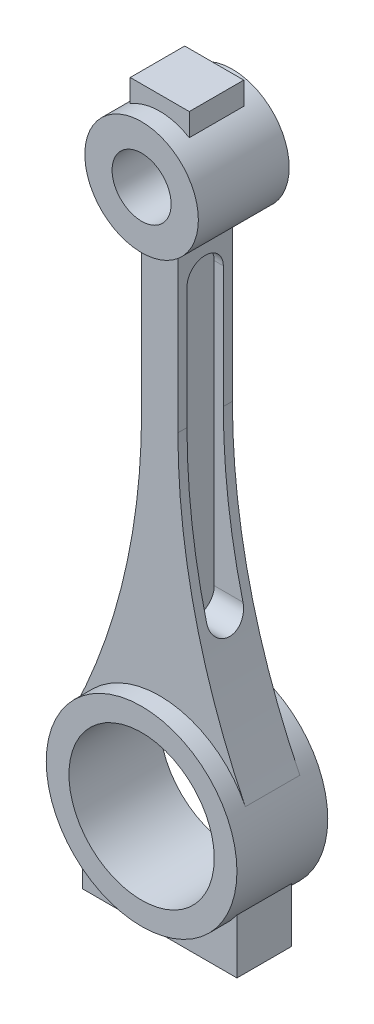
ISO-10303-21;
HEADER;
FILE_DESCRIPTION(('STEP AP214'),'2;1');
FILE_NAME('part.step','',(''),(''),'','','');
FILE_SCHEMA(('AUTOMOTIVE_DESIGN { 1 0 10303 214 1 1 1 1 }'));
ENDSEC;
DATA;
#1=APPLICATION_CONTEXT('core data for automotive mechanical design processes');
#2=APPLICATION_PROTOCOL_DEFINITION('international standard','automotive_design',2000,#1);
#3=PRODUCT_CONTEXT('',#1,'mechanical');
#4=PRODUCT('Part','Part','',(#3));
#5=PRODUCT_RELATED_PRODUCT_CATEGORY('part','',(#4));
#6=PRODUCT_DEFINITION_FORMATION('','',#4);
#7=PRODUCT_DEFINITION_CONTEXT('part definition',#1,'design');
#8=PRODUCT_DEFINITION('design','',#6,#7);
#9=PRODUCT_DEFINITION_SHAPE('','',#8);
#10=(LENGTH_UNIT() NAMED_UNIT(*) SI_UNIT(.MILLI.,.METRE.));
#11=(NAMED_UNIT(*) PLANE_ANGLE_UNIT() SI_UNIT($,.RADIAN.));
#12=(NAMED_UNIT(*) SI_UNIT($,.STERADIAN.) SOLID_ANGLE_UNIT());
#13=UNCERTAINTY_MEASURE_WITH_UNIT(LENGTH_MEASURE(1.E-05),#10,'distance_accuracy_value','');
#14=(GEOMETRIC_REPRESENTATION_CONTEXT(3) GLOBAL_UNCERTAINTY_ASSIGNED_CONTEXT((#13)) GLOBAL_UNIT_ASSIGNED_CONTEXT((#10,
#11,#12)) REPRESENTATION_CONTEXT('',''));
#15=CARTESIAN_POINT('',(0.,0.,0.));
#16=DIRECTION('',(0.,0.,1.));
#17=DIRECTION('',(1.,0.,0.));
#18=AXIS2_PLACEMENT_3D('',#15,#16,#17);
#19=CARTESIAN_POINT('',(148.911403588365,-46.842719282327,6.));
#20=DIRECTION('',(0.,0.,-1.));
#21=DIRECTION('',(-1.,0.,0.));
#22=AXIS2_PLACEMENT_3D('',#19,#20,#21);
#23=CYLINDRICAL_SURFACE('',#22,144.911403588365);
#24=DIRECTION('',(0.,0.,-1.));
#25=VECTOR('',#24,1.);
#26=CARTESIAN_POINT('',(4.,-46.842719282327,6.));
#27=LINE('',#26,#25);
#28=CARTESIAN_POINT('',(4.,-46.842719282327,-4.));
#29=VERTEX_POINT('',#28);
#30=CARTESIAN_POINT('',(4.,-46.842719282327,-6.));
#31=VERTEX_POINT('',#30);
#32=EDGE_CURVE('E387',#29,#31,#27,.T.);
#33=ORIENTED_EDGE('',*,*,#32,.F.);
#34=CARTESIAN_POINT('',(148.911403588365,-46.842719282327,-4.));
#35=DIRECTION('',(0.,0.,1.));
#36=DIRECTION('',(1.,0.,0.));
#37=AXIS2_PLACEMENT_3D('',#34,#35,#36);
#38=CIRCLE('',#37,144.911403588365);
#39=CARTESIAN_POINT('',(8.32946839579221,-82.,-4.));
#40=VERTEX_POINT('',#39);
#41=EDGE_CURVE('E239',#29,#40,#38,.T.);
#42=ORIENTED_EDGE('',*,*,#41,.T.);
#43=CARTESIAN_POINT('',(8.32946839579221,-82.,-4.));
#44=CARTESIAN_POINT('',(8.35837260753617,-82.1155838754006,-4.00000874523484));
#45=CARTESIAN_POINT('',(8.38742066172271,-82.2311257590194,-3.99499010452966));
#46=CARTESIAN_POINT('',(8.44559279586119,-82.4613222165068,-3.97498579266261));
#47=CARTESIAN_POINT('',(8.47471687444068,-82.5759768062473,-3.96000030020519));
#48=CARTESIAN_POINT('',(8.53283267046999,-82.8036082497815,-3.92014849754489));
#49=CARTESIAN_POINT('',(8.56182437763423,-82.9165849746877,-3.89528143230587));
#50=CARTESIAN_POINT('',(8.61944225017928,-83.1400168950437,-3.83584971060536));
#51=CARTESIAN_POINT('',(8.64806842086389,-83.2504721270979,-3.8012851950184));
#52=CARTESIAN_POINT('',(8.7331013422553,-83.5770198694853,-3.68327068137728));
#53=CARTESIAN_POINT('',(8.78867833589756,-83.7883563565845,-3.58548884497471));
#54=CARTESIAN_POINT('',(8.89559591006272,-84.1915095041504,-3.35429989024324));
#55=CARTESIAN_POINT('',(8.94693802861055,-84.3833332572217,-3.22090578083886));
#56=CARTESIAN_POINT('',(9.04300576815875,-84.7396830550554,-2.92358052770057));
#57=CARTESIAN_POINT('',(9.08780131435431,-84.9045002885207,-2.76002207409606));
#58=CARTESIAN_POINT('',(9.1697090629255,-85.2041309943854,-2.40569412503592));
#59=CARTESIAN_POINT('',(9.20682139215513,-85.3389449621574,-2.21492507892954));
#60=CARTESIAN_POINT('',(9.27072101308072,-85.5700821030688,-1.81811355062964));
#61=CARTESIAN_POINT('',(9.29780102039584,-85.6675001245802,-1.61275626380543));
#62=CARTESIAN_POINT('',(9.34207733010017,-85.826368651202,-1.18758849871992));
#63=CARTESIAN_POINT('',(9.35927642901819,-85.8878293331734,-0.967782129534331));
#64=CARTESIAN_POINT('',(9.38260496428717,-85.9711112965693,-0.527914983305013));
#65=CARTESIAN_POINT('',(9.38908744428568,-85.9941969380078,-0.308111695869451));
#66=CARTESIAN_POINT('',(9.39180268836639,-86.0038721042121,0.13235163572554));
#67=CARTESIAN_POINT('',(9.38803648660552,-85.9904653112958,0.353011591198101));
#68=CARTESIAN_POINT('',(9.37056692256844,-85.9281486758924,0.785217084723297));
#69=CARTESIAN_POINT('',(9.35702353638242,-85.8798103764088,0.996851968052392));
#70=CARTESIAN_POINT('',(9.320754146738,-85.7499164259824,1.40882234930645));
#71=CARTESIAN_POINT('',(9.29802789750906,-85.6683598859847,1.60915754464249));
#72=CARTESIAN_POINT('',(9.24402839371224,-85.4736584165545,1.99522585182686));
#73=CARTESIAN_POINT('',(9.21266853643914,-85.3601931525549,2.18078503400007));
#74=CARTESIAN_POINT('',(9.14271538853011,-85.1055742787722,2.53025004617875));
#75=CARTESIAN_POINT('',(9.10412150934586,-84.9644184160832,2.69415411250794));
#76=CARTESIAN_POINT('',(9.01981577606695,-84.6538968272369,3.00098201513396));
#77=CARTESIAN_POINT('',(8.97392485663143,-84.4838107742403,3.14312725760148));
#78=CARTESIAN_POINT('',(8.87747412379945,-84.1233879962609,3.39703478208648));
#79=CARTESIAN_POINT('',(8.82691201718461,-83.9330413177107,3.50878203354318));
#80=CARTESIAN_POINT('',(8.72093513280076,-83.5304860720347,3.70260044170905));
#81=CARTESIAN_POINT('',(8.66541311083078,-83.3177497748887,3.78351453035859));
#82=CARTESIAN_POINT('',(8.55285996455555,-82.8822045924085,3.90805235050602));
#83=CARTESIAN_POINT('',(8.49583103238981,-82.6594100370179,3.95172747426984));
#84=CARTESIAN_POINT('',(8.42061430849379,-82.3625538070276,3.98420167842466));
#85=CARTESIAN_POINT('',(8.40232032365708,-82.2901173866357,3.99012850935214));
#86=CARTESIAN_POINT('',(8.36582413413568,-82.1451347738394,3.99802244183978));
#87=CARTESIAN_POINT('',(8.34762182727392,-82.0725889659064,3.99999612991472));
#88=CARTESIAN_POINT('',(8.32946839579223,-82.,4.));
#89=B_SPLINE_CURVE_WITH_KNOTS('',3,(#43,#44,#45,#46,#47,#48,#49,#50,#51,#52,#53,#54,#55,#56,#57,
#58,#59,#60,#61,#62,#63,#64,#65,#66,#67,#68,#69,#70,#71,#72,#73,#74,#75,#76,#77,#78,#79,#80,#81,
#82,#83,#84,#85,#86,#87,#88),.UNSPECIFIED.,.F.,.F.,(4,2,2,2,2,2,2,2,2,2,2,2,2,2,2,2,2,2,2,2,2,2,
4),(0.,0.357313371389551,0.71462033636667,1.07195460788373,1.42928368868642,2.143749776244,
2.85795523039647,3.5638650499022,4.26976321353058,4.95304444363999,5.63613219374617,
6.29623235756107,6.95626591555552,7.60573779643776,8.25522706096615,8.91148484382824,
9.56779604195492,10.2438322043452,10.9202020338022,11.619910885033,12.318652520939,
12.543414847487,12.7678023745308),.UNSPECIFIED.);
#90=CARTESIAN_POINT('',(8.32946839579221,-82.,4.));
#91=VERTEX_POINT('',#90);
#92=EDGE_CURVE('E11',#40,#91,#89,.T.);
#93=ORIENTED_EDGE('',*,*,#92,.T.);
#94=CARTESIAN_POINT('',(148.911403588365,-46.842719282327,4.));
#95=DIRECTION('',(0.,0.,-1.));
#96=DIRECTION('',(-1.,0.,0.));
#97=AXIS2_PLACEMENT_3D('',#94,#95,#96);
#98=CIRCLE('',#97,144.911403588365);
#99=CARTESIAN_POINT('',(4.,-46.842719282327,4.));
#100=VERTEX_POINT('',#99);
#101=EDGE_CURVE('E214',#91,#100,#98,.T.);
#102=ORIENTED_EDGE('',*,*,#101,.T.);
#103=CARTESIAN_POINT('',(4.,-46.842719282327,6.));
#104=VERTEX_POINT('',#103);
#105=EDGE_CURVE('E388',#104,#100,#27,.T.);
#106=ORIENTED_EDGE('',*,*,#105,.F.);
#107=CARTESIAN_POINT('',(148.911403588365,-46.842719282327,6.));
#108=DIRECTION('',(0.,0.,1.));
#109=DIRECTION('',(1.,0.,0.));
#110=AXIS2_PLACEMENT_3D('',#107,#108,#109);
#111=CIRCLE('',#110,144.911403588365);
#112=CARTESIAN_POINT('',(18.8482491722767,-110.740221215398,6.));
#113=VERTEX_POINT('',#112);
#114=EDGE_CURVE('E341',#104,#113,#111,.T.);
#115=ORIENTED_EDGE('',*,*,#114,.T.);
#116=DIRECTION('',(0.,0.,-1.));
#117=VECTOR('',#116,1.);
#118=CARTESIAN_POINT('',(18.8482491722767,-110.740221215398,6.));
#119=LINE('',#118,#117);
#120=CARTESIAN_POINT('',(18.8482491722767,-110.740221215398,-6.));
#121=VERTEX_POINT('',#120);
#122=EDGE_CURVE('E357',#113,#121,#119,.T.);
#123=ORIENTED_EDGE('',*,*,#122,.T.);
#124=CARTESIAN_POINT('',(148.911403588365,-46.842719282327,-6.));
#125=DIRECTION('',(0.,0.,1.));
#126=DIRECTION('',(1.,0.,0.));
#127=AXIS2_PLACEMENT_3D('',#124,#125,#126);
#128=CIRCLE('',#127,144.911403588365);
#129=EDGE_CURVE('E336',#31,#121,#128,.T.);
#130=ORIENTED_EDGE('',*,*,#129,.F.);
#131=EDGE_LOOP('',(#33,#42,#93,#102,#106,#115,#123,#130));
#132=FACE_BOUND('',#131,.T.);
#133=ADVANCED_FACE('F38',(#132),#23,.F.);
#134=CARTESIAN_POINT('',(4.,0.,6.));
#135=DIRECTION('',(1.,0.,0.));
#136=DIRECTION('',(0.,1.,0.));
#137=AXIS2_PLACEMENT_3D('',#134,#135,#136);
#138=PLANE('',#137);
#139=CARTESIAN_POINT('',(4.,-20.,0.));
#140=DIRECTION('',(1.,0.,0.));
#141=DIRECTION('',(0.,1.,0.));
#142=AXIS2_PLACEMENT_3D('',#139,#140,#141);
#143=CIRCLE('',#142,4.);
#144=CARTESIAN_POINT('',(4.,-20.,4.));
#145=VERTEX_POINT('',#144);
#146=CARTESIAN_POINT('',(4.,-20.,-4.));
#147=VERTEX_POINT('',#146);
#148=EDGE_CURVE('E547',#145,#147,#143,.F.);
#149=ORIENTED_EDGE('',*,*,#148,.T.);
#150=DIRECTION('',(0.,-1.,0.));
#151=VECTOR('',#150,1.);
#152=CARTESIAN_POINT('',(4.,0.,-4.));
#153=LINE('',#152,#151);
#154=EDGE_CURVE('E52',#147,#29,#153,.T.);
#155=ORIENTED_EDGE('',*,*,#154,.T.);
#156=ORIENTED_EDGE('',*,*,#32,.T.);
#157=DIRECTION('',(0.,-1.,0.));
#158=VECTOR('',#157,1.);
#159=CARTESIAN_POINT('',(4.,0.,-6.));
#160=LINE('',#159,#158);
#161=CARTESIAN_POINT('',(4.,-11.842719282327,-6.));
#162=VERTEX_POINT('',#161);
#163=EDGE_CURVE('E360',#162,#31,#160,.T.);
#164=ORIENTED_EDGE('',*,*,#163,.F.);
#165=DIRECTION('',(0.,0.,-1.));
#166=VECTOR('',#165,1.);
#167=CARTESIAN_POINT('',(4.,-11.842719282327,6.));
#168=LINE('',#167,#166);
#169=CARTESIAN_POINT('',(4.,-11.842719282327,6.));
#170=VERTEX_POINT('',#169);
#171=EDGE_CURVE('E385',#170,#162,#168,.T.);
#172=ORIENTED_EDGE('',*,*,#171,.F.);
#173=DIRECTION('',(0.,-1.,0.));
#174=VECTOR('',#173,1.);
#175=CARTESIAN_POINT('',(4.,0.,6.));
#176=LINE('',#175,#174);
#177=EDGE_CURVE('E344',#170,#104,#176,.T.);
#178=ORIENTED_EDGE('',*,*,#177,.T.);
#179=ORIENTED_EDGE('',*,*,#105,.T.);
#180=DIRECTION('',(0.,1.,0.));
#181=VECTOR('',#180,1.);
#182=CARTESIAN_POINT('',(4.,0.,4.));
#183=LINE('',#182,#181);
#184=EDGE_CURVE('E548',#100,#145,#183,.T.);
#185=ORIENTED_EDGE('',*,*,#184,.T.);
#186=EDGE_LOOP('',(#149,#155,#156,#164,#172,#178,#179,#185));
#187=FACE_BOUND('',#186,.T.);
#188=ADVANCED_FACE('F495',(#187),#138,.T.);
#189=CARTESIAN_POINT('',(0.,-120.,10.));
#190=DIRECTION('',(0.,0.,-1.));
#191=DIRECTION('',(-1.,0.,0.));
#192=AXIS2_PLACEMENT_3D('',#189,#190,#191);
#193=CYLINDRICAL_SURFACE('',#192,16.);
#194=CARTESIAN_POINT('',(0.,-120.,10.));
#195=DIRECTION('',(0.,0.,1.));
#196=DIRECTION('',(1.,0.,0.));
#197=AXIS2_PLACEMENT_3D('',#194,#195,#196);
#198=CIRCLE('',#197,16.);
#199=CARTESIAN_POINT('',(16.,-120.,10.));
#200=VERTEX_POINT('',#199);
#201=EDGE_CURVE('E392',#200,#200,#198,.T.);
#202=ORIENTED_EDGE('',*,*,#201,.T.);
#203=EDGE_LOOP('',(#202));
#204=FACE_BOUND('',#203,.T.);
#205=CARTESIAN_POINT('',(0.,-120.,-10.));
#206=DIRECTION('',(0.,0.,1.));
#207=DIRECTION('',(1.,0.,0.));
#208=AXIS2_PLACEMENT_3D('',#205,#206,#207);
#209=CIRCLE('',#208,16.);
#210=CARTESIAN_POINT('',(16.,-120.,-10.));
#211=VERTEX_POINT('',#210);
#212=EDGE_CURVE('E391',#211,#211,#209,.T.);
#213=ORIENTED_EDGE('',*,*,#212,.F.);
#214=EDGE_LOOP('',(#213));
#215=FACE_BOUND('',#214,.T.);
#216=ADVANCED_FACE('F40',(#204,#215),#193,.F.);
#217=CARTESIAN_POINT('',(0.,-120.,10.));
#218=DIRECTION('',(0.,0.,-1.));
#219=DIRECTION('',(-1.,0.,0.));
#220=AXIS2_PLACEMENT_3D('',#217,#218,#219);
#221=CYLINDRICAL_SURFACE('',#220,21.);
#222=DIRECTION('',(0.,0.,-1.));
#223=VECTOR('',#222,1.);
#224=CARTESIAN_POINT('',(-17.,-132.328828005938,6.));
#225=LINE('',#224,#223);
#226=CARTESIAN_POINT('',(-17.,-132.328828005938,6.));
#227=VERTEX_POINT('',#226);
#228=CARTESIAN_POINT('',(-17.,-132.328828005938,-6.));
#229=VERTEX_POINT('',#228);
#230=EDGE_CURVE('E325',#227,#229,#225,.T.);
#231=ORIENTED_EDGE('',*,*,#230,.F.);
#232=CARTESIAN_POINT('',(0.,-120.,6.));
#233=DIRECTION('',(0.,0.,1.));
#234=DIRECTION('',(1.,0.,0.));
#235=AXIS2_PLACEMENT_3D('',#232,#233,#234);
#236=CIRCLE('',#235,21.);
#237=CARTESIAN_POINT('',(17.,-132.328828005938,6.));
#238=VERTEX_POINT('',#237);
#239=EDGE_CURVE('E298',#227,#238,#236,.T.);
#240=ORIENTED_EDGE('',*,*,#239,.T.);
#241=DIRECTION('',(0.,0.,-1.));
#242=VECTOR('',#241,1.);
#243=CARTESIAN_POINT('',(17.,-132.328828005938,6.));
#244=LINE('',#243,#242);
#245=CARTESIAN_POINT('',(17.,-132.328828005938,-6.));
#246=VERTEX_POINT('',#245);
#247=EDGE_CURVE('E309',#238,#246,#244,.T.);
#248=ORIENTED_EDGE('',*,*,#247,.T.);
#249=CARTESIAN_POINT('',(0.,-120.,-6.));
#250=DIRECTION('',(0.,0.,1.));
#251=DIRECTION('',(1.,0.,0.));
#252=AXIS2_PLACEMENT_3D('',#249,#250,#251);
#253=CIRCLE('',#252,21.);
#254=EDGE_CURVE('E297',#229,#246,#253,.T.);
#255=ORIENTED_EDGE('',*,*,#254,.F.);
#256=EDGE_LOOP('',(#231,#240,#248,#255));
#257=FACE_BOUND('',#256,.T.);
#258=ORIENTED_EDGE('',*,*,#122,.F.);
#259=CARTESIAN_POINT('',(0.,-120.,6.));
#260=DIRECTION('',(0.,0.,1.));
#261=DIRECTION('',(1.,0.,0.));
#262=AXIS2_PLACEMENT_3D('',#259,#260,#261);
#263=CIRCLE('',#262,21.);
#264=CARTESIAN_POINT('',(-18.8482491722767,-110.740221215398,6.));
#265=VERTEX_POINT('',#264);
#266=EDGE_CURVE('E355',#113,#265,#263,.T.);
#267=ORIENTED_EDGE('',*,*,#266,.T.);
#268=DIRECTION('',(0.,0.,-1.));
#269=VECTOR('',#268,1.);
#270=CARTESIAN_POINT('',(-18.8482491722767,-110.740221215398,6.));
#271=LINE('',#270,#269);
#272=CARTESIAN_POINT('',(-18.8482491722767,-110.740221215398,-6.));
#273=VERTEX_POINT('',#272);
#274=EDGE_CURVE('E376',#265,#273,#271,.T.);
#275=ORIENTED_EDGE('',*,*,#274,.T.);
#276=CARTESIAN_POINT('',(0.,-120.,-6.));
#277=DIRECTION('',(0.,0.,1.));
#278=DIRECTION('',(1.,0.,0.));
#279=AXIS2_PLACEMENT_3D('',#276,#277,#278);
#280=CIRCLE('',#279,21.);
#281=EDGE_CURVE('E345',#121,#273,#280,.T.);
#282=ORIENTED_EDGE('',*,*,#281,.F.);
#283=EDGE_LOOP('',(#258,#267,#275,#282));
#284=FACE_BOUND('',#283,.T.);
#285=CARTESIAN_POINT('',(0.,-120.,10.));
#286=DIRECTION('',(0.,0.,1.));
#287=DIRECTION('',(1.,0.,0.));
#288=AXIS2_PLACEMENT_3D('',#285,#286,#287);
#289=CIRCLE('',#288,21.);
#290=CARTESIAN_POINT('',(21.,-120.,10.));
#291=VERTEX_POINT('',#290);
#292=EDGE_CURVE('E395',#291,#291,#289,.T.);
#293=ORIENTED_EDGE('',*,*,#292,.F.);
#294=EDGE_LOOP('',(#293));
#295=FACE_BOUND('',#294,.T.);
#296=CARTESIAN_POINT('',(0.,-120.,-10.));
#297=DIRECTION('',(0.,0.,1.));
#298=DIRECTION('',(1.,0.,0.));
#299=AXIS2_PLACEMENT_3D('',#296,#297,#298);
#300=CIRCLE('',#299,21.);
#301=CARTESIAN_POINT('',(21.,-120.,-10.));
#302=VERTEX_POINT('',#301);
#303=EDGE_CURVE('E396',#302,#302,#300,.T.);
#304=ORIENTED_EDGE('',*,*,#303,.T.);
#305=EDGE_LOOP('',(#304));
#306=FACE_BOUND('',#305,.T.);
#307=ADVANCED_FACE('F510',(#257,#284,#295,#306),#221,.T.);
#308=CARTESIAN_POINT('',(0.,0.,10.));
#309=DIRECTION('',(0.,0.,1.));
#310=DIRECTION('',(1.,0.,0.));
#311=AXIS2_PLACEMENT_3D('',#308,#309,#310);
#312=PLANE('',#311);
#313=ORIENTED_EDGE('',*,*,#201,.F.);
#314=EDGE_LOOP('',(#313));
#315=FACE_BOUND('',#314,.T.);
#316=ORIENTED_EDGE('',*,*,#292,.T.);
#317=EDGE_LOOP('',(#316));
#318=FACE_BOUND('',#317,.T.);
#319=ADVANCED_FACE('F506',(#315,#318),#312,.T.);
#320=CARTESIAN_POINT('',(0.,0.,-10.));
#321=DIRECTION('',(0.,0.,1.));
#322=DIRECTION('',(1.,0.,0.));
#323=AXIS2_PLACEMENT_3D('',#320,#321,#322);
#324=PLANE('',#323);
#325=ORIENTED_EDGE('',*,*,#212,.T.);
#326=EDGE_LOOP('',(#325));
#327=FACE_BOUND('',#326,.T.);
#328=ORIENTED_EDGE('',*,*,#303,.F.);
#329=EDGE_LOOP('',(#328));
#330=FACE_BOUND('',#329,.T.);
#331=ADVANCED_FACE('F509',(#327,#330),#324,.F.);
#332=CARTESIAN_POINT('',(-4.,0.,6.));
#333=DIRECTION('',(1.,0.,0.));
#334=DIRECTION('',(0.,1.,0.));
#335=AXIS2_PLACEMENT_3D('',#332,#333,#334);
#336=PLANE('',#335);
#337=CARTESIAN_POINT('',(-4.,-20.,0.));
#338=DIRECTION('',(1.,0.,0.));
#339=DIRECTION('',(0.,1.,0.));
#340=AXIS2_PLACEMENT_3D('',#337,#338,#339);
#341=CIRCLE('',#340,4.);
#342=CARTESIAN_POINT('',(-4.,-20.,-4.));
#343=VERTEX_POINT('',#342);
#344=CARTESIAN_POINT('',(-4.,-20.,4.));
#345=VERTEX_POINT('',#344);
#346=EDGE_CURVE('E551',#343,#345,#341,.T.);
#347=ORIENTED_EDGE('',*,*,#346,.T.);
#348=DIRECTION('',(0.,-1.,0.));
#349=VECTOR('',#348,1.);
#350=CARTESIAN_POINT('',(-4.,0.,4.));
#351=LINE('',#350,#349);
#352=CARTESIAN_POINT('',(-3.99999999999998,-46.842719282327,4.));
#353=VERTEX_POINT('',#352);
#354=EDGE_CURVE('E262',#345,#353,#351,.T.);
#355=ORIENTED_EDGE('',*,*,#354,.T.);
#356=DIRECTION('',(0.,0.,-1.));
#357=VECTOR('',#356,1.);
#358=CARTESIAN_POINT('',(-4.,-46.842719282327,6.));
#359=LINE('',#358,#357);
#360=CARTESIAN_POINT('',(-4.,-46.842719282327,6.));
#361=VERTEX_POINT('',#360);
#362=EDGE_CURVE('E379',#361,#353,#359,.T.);
#363=ORIENTED_EDGE('',*,*,#362,.F.);
#364=DIRECTION('',(0.,-1.,0.));
#365=VECTOR('',#364,1.);
#366=CARTESIAN_POINT('',(-4.,0.,6.));
#367=LINE('',#366,#365);
#368=CARTESIAN_POINT('',(-4.,-11.842719282327,6.));
#369=VERTEX_POINT('',#368);
#370=EDGE_CURVE('E350',#369,#361,#367,.T.);
#371=ORIENTED_EDGE('',*,*,#370,.F.);
#372=DIRECTION('',(0.,0.,-1.));
#373=VECTOR('',#372,1.);
#374=CARTESIAN_POINT('',(-4.,-11.842719282327,6.));
#375=LINE('',#374,#373);
#376=CARTESIAN_POINT('',(-4.,-11.842719282327,-6.));
#377=VERTEX_POINT('',#376);
#378=EDGE_CURVE('E382',#369,#377,#375,.T.);
#379=ORIENTED_EDGE('',*,*,#378,.T.);
#380=DIRECTION('',(0.,-1.,0.));
#381=VECTOR('',#380,1.);
#382=CARTESIAN_POINT('',(-4.,0.,-6.));
#383=LINE('',#382,#381);
#384=CARTESIAN_POINT('',(-4.,-46.842719282327,-6.));
#385=VERTEX_POINT('',#384);
#386=EDGE_CURVE('E366',#377,#385,#383,.T.);
#387=ORIENTED_EDGE('',*,*,#386,.T.);
#388=CARTESIAN_POINT('',(-4.,-46.842719282327,-4.));
#389=VERTEX_POINT('',#388);
#390=EDGE_CURVE('E378',#389,#385,#359,.T.);
#391=ORIENTED_EDGE('',*,*,#390,.F.);
#392=DIRECTION('',(0.,1.,0.));
#393=VECTOR('',#392,1.);
#394=CARTESIAN_POINT('',(-4.,0.,-4.));
#395=LINE('',#394,#393);
#396=EDGE_CURVE('E67',#389,#343,#395,.T.);
#397=ORIENTED_EDGE('',*,*,#396,.T.);
#398=EDGE_LOOP('',(#347,#355,#363,#371,#379,#387,#391,#397));
#399=FACE_BOUND('',#398,.T.);
#400=ADVANCED_FACE('F513',(#399),#336,.F.);
#401=CARTESIAN_POINT('',(-148.911403588365,-46.842719282327,6.));
#402=DIRECTION('',(0.,0.,-1.));
#403=DIRECTION('',(-1.,0.,0.));
#404=AXIS2_PLACEMENT_3D('',#401,#402,#403);
#405=CYLINDRICAL_SURFACE('',#404,144.911403588365);
#406=ORIENTED_EDGE('',*,*,#362,.T.);
#407=CARTESIAN_POINT('',(-148.911403588365,-46.842719282327,4.));
#408=DIRECTION('',(0.,0.,1.));
#409=DIRECTION('',(1.,0.,0.));
#410=AXIS2_PLACEMENT_3D('',#407,#408,#409);
#411=CIRCLE('',#410,144.911403588365);
#412=CARTESIAN_POINT('',(-8.32946839579218,-82.,4.));
#413=VERTEX_POINT('',#412);
#414=EDGE_CURVE('E414',#353,#413,#411,.F.);
#415=ORIENTED_EDGE('',*,*,#414,.T.);
#416=CARTESIAN_POINT('',(-8.32946839579218,-82.,4.));
#417=CARTESIAN_POINT('',(-8.35837260753614,-82.1155838754006,4.00000874523484));
#418=CARTESIAN_POINT('',(-8.38742066172268,-82.2311257590194,3.99499010452966));
#419=CARTESIAN_POINT('',(-8.44559279586115,-82.4613222165068,3.97498579266261));
#420=CARTESIAN_POINT('',(-8.47471687444064,-82.5759768062473,3.96000030020519));
#421=CARTESIAN_POINT('',(-8.53283267046994,-82.8036082497815,3.92014849754488));
#422=CARTESIAN_POINT('',(-8.56182437763419,-82.9165849746877,3.89528143230587));
#423=CARTESIAN_POINT('',(-8.61944225017924,-83.1400168950437,3.83584971060536));
#424=CARTESIAN_POINT('',(-8.64806842086386,-83.2504721270979,3.8012851950184));
#425=CARTESIAN_POINT('',(-8.73310134225529,-83.5770198694853,3.68327068137728));
#426=CARTESIAN_POINT('',(-8.78867833589755,-83.7883563565845,3.58548884497471));
#427=CARTESIAN_POINT('',(-8.8955959100627,-84.1915095041504,3.35429989024324));
#428=CARTESIAN_POINT('',(-8.94693802861049,-84.3833332572217,3.22090578083886));
#429=CARTESIAN_POINT('',(-9.04300576815869,-84.7396830550554,2.92358052770057));
#430=CARTESIAN_POINT('',(-9.08780131435428,-84.9045002885207,2.76002207409607));
#431=CARTESIAN_POINT('',(-9.16970906292547,-85.2041309943854,2.40569412503593));
#432=CARTESIAN_POINT('',(-9.20682139215508,-85.3389449621574,2.21492507892955));
#433=CARTESIAN_POINT('',(-9.27072101308066,-85.5700821030688,1.81811355062965));
#434=CARTESIAN_POINT('',(-9.2978010203958,-85.6675001245802,1.61275626380545));
#435=CARTESIAN_POINT('',(-9.34207733010014,-85.826368651202,1.18758849871993));
#436=CARTESIAN_POINT('',(-9.35927642901815,-85.8878293331734,0.967782129534333));
#437=CARTESIAN_POINT('',(-9.3826049642871,-85.9711112965693,0.527914983305012));
#438=CARTESIAN_POINT('',(-9.38908744428561,-85.9941969380078,0.308111695869451));
#439=CARTESIAN_POINT('',(-9.39180268836633,-86.0038721042121,-0.132351635725541));
#440=CARTESIAN_POINT('',(-9.38803648660549,-85.9904653112958,-0.353011591198104));
#441=CARTESIAN_POINT('',(-9.37056692256842,-85.9281486758923,-0.7852170847233));
#442=CARTESIAN_POINT('',(-9.35702353638239,-85.8798103764088,-0.996851968052393));
#443=CARTESIAN_POINT('',(-9.32075414673796,-85.7499164259824,-1.40882234930645));
#444=CARTESIAN_POINT('',(-9.29802789750901,-85.6683598859847,-1.6091575446425));
#445=CARTESIAN_POINT('',(-9.24402839371218,-85.4736584165545,-1.99522585182687));
#446=CARTESIAN_POINT('',(-9.21266853643909,-85.3601931525549,-2.18078503400007));
#447=CARTESIAN_POINT('',(-9.14271538853006,-85.1055742787722,-2.53025004617875));
#448=CARTESIAN_POINT('',(-9.10412150934581,-84.9644184160832,-2.69415411250795));
#449=CARTESIAN_POINT('',(-9.0198157760669,-84.6538968272369,-3.00098201513396));
#450=CARTESIAN_POINT('',(-8.97392485663138,-84.4838107742403,-3.14312725760147));
#451=CARTESIAN_POINT('',(-8.8774741237994,-84.1233879962609,-3.39703478208647));
#452=CARTESIAN_POINT('',(-8.82691201718455,-83.9330413177107,-3.50878203354317));
#453=CARTESIAN_POINT('',(-8.7209351328007,-83.5304860720347,-3.70260044170905));
#454=CARTESIAN_POINT('',(-8.66541311083073,-83.3177497748888,-3.78351453035859));
#455=CARTESIAN_POINT('',(-8.55285996455549,-82.8822045924085,-3.90805235050601));
#456=CARTESIAN_POINT('',(-8.49583103238976,-82.6594100370179,-3.95172747426984));
#457=CARTESIAN_POINT('',(-8.42061430849374,-82.3625538070276,-3.98420167842466));
#458=CARTESIAN_POINT('',(-8.40232032365702,-82.2901173866357,-3.99012850935214));
#459=CARTESIAN_POINT('',(-8.36582413413563,-82.1451347738394,-3.99802244183978));
#460=CARTESIAN_POINT('',(-8.34762182727386,-82.0725889659064,-3.99999612991472));
#461=CARTESIAN_POINT('',(-8.32946839579218,-82.,-4.));
#462=B_SPLINE_CURVE_WITH_KNOTS('',3,(#416,#417,#418,#419,#420,#421,#422,#423,#424,#425,#426,
#427,#428,#429,#430,#431,#432,#433,#434,#435,#436,#437,#438,#439,#440,#441,#442,#443,#444,#445,
#446,#447,#448,#449,#450,#451,#452,#453,#454,#455,#456,#457,#458,#459,#460,#461),.UNSPECIFIED.,
.F.,.F.,(4,2,2,2,2,2,2,2,2,2,2,2,2,2,2,2,2,2,2,2,2,2,4),(0.,0.357313371389549,0.714620336366666,
1.07195460788374,1.42928368868642,2.14374977624399,2.85795523039646,3.56386504990218,
4.26976321353056,4.95304444363998,5.63613219374616,6.29623235756106,6.95626591555552,
7.60573779643776,8.25522706096615,8.91148484382823,9.56779604195491,10.2438322043451,
10.9202020338022,11.619910885033,12.318652520939,12.543414847487,12.7678023745308),.UNSPECIFIED.);
#463=CARTESIAN_POINT('',(-8.32946839579218,-82.,-4.));
#464=VERTEX_POINT('',#463);
#465=EDGE_CURVE('E405',#413,#464,#462,.T.);
#466=ORIENTED_EDGE('',*,*,#465,.T.);
#467=CARTESIAN_POINT('',(-148.911403588365,-46.842719282327,-4.));
#468=DIRECTION('',(0.,0.,-1.));
#469=DIRECTION('',(-1.,0.,0.));
#470=AXIS2_PLACEMENT_3D('',#467,#468,#469);
#471=CIRCLE('',#470,144.911403588365);
#472=EDGE_CURVE('E399',#464,#389,#471,.F.);
#473=ORIENTED_EDGE('',*,*,#472,.T.);
#474=ORIENTED_EDGE('',*,*,#390,.T.);
#475=CARTESIAN_POINT('',(-148.911403588365,-46.842719282327,-6.));
#476=DIRECTION('',(0.,0.,1.));
#477=DIRECTION('',(1.,0.,0.));
#478=AXIS2_PLACEMENT_3D('',#475,#476,#477);
#479=CIRCLE('',#478,144.911403588365);
#480=EDGE_CURVE('E369',#385,#273,#479,.F.);
#481=ORIENTED_EDGE('',*,*,#480,.T.);
#482=ORIENTED_EDGE('',*,*,#274,.F.);
#483=CARTESIAN_POINT('',(-148.911403588365,-46.842719282327,6.));
#484=DIRECTION('',(0.,0.,1.));
#485=DIRECTION('',(1.,0.,0.));
#486=AXIS2_PLACEMENT_3D('',#483,#484,#485);
#487=CIRCLE('',#486,144.911403588365);
#488=EDGE_CURVE('E352',#361,#265,#487,.F.);
#489=ORIENTED_EDGE('',*,*,#488,.F.);
#490=EDGE_LOOP('',(#406,#415,#466,#473,#474,#481,#482,#489));
#491=FACE_BOUND('',#490,.T.);
#492=ADVANCED_FACE('F416',(#491),#405,.F.);
#493=CARTESIAN_POINT('',(0.,0.,6.));
#494=DIRECTION('',(0.,0.,1.));
#495=DIRECTION('',(1.,0.,0.));
#496=AXIS2_PLACEMENT_3D('',#493,#494,#495);
#497=PLANE('',#496);
#498=ORIENTED_EDGE('',*,*,#114,.F.);
#499=ORIENTED_EDGE('',*,*,#177,.F.);
#500=CARTESIAN_POINT('',(0.,0.,6.));
#501=DIRECTION('',(0.,0.,1.));
#502=DIRECTION('',(1.,0.,0.));
#503=AXIS2_PLACEMENT_3D('',#500,#501,#502);
#504=CIRCLE('',#503,12.5);
#505=EDGE_CURVE('E348',#369,#170,#504,.T.);
#506=ORIENTED_EDGE('',*,*,#505,.F.);
#507=ORIENTED_EDGE('',*,*,#370,.T.);
#508=ORIENTED_EDGE('',*,*,#488,.T.);
#509=ORIENTED_EDGE('',*,*,#266,.F.);
#510=EDGE_LOOP('',(#498,#499,#506,#507,#508,#509));
#511=FACE_BOUND('',#510,.T.);
#512=ADVANCED_FACE('F487',(#511),#497,.T.);
#513=CARTESIAN_POINT('',(0.,0.,-6.));
#514=DIRECTION('',(0.,0.,1.));
#515=DIRECTION('',(1.,0.,0.));
#516=AXIS2_PLACEMENT_3D('',#513,#514,#515);
#517=PLANE('',#516);
#518=ORIENTED_EDGE('',*,*,#129,.T.);
#519=ORIENTED_EDGE('',*,*,#281,.T.);
#520=ORIENTED_EDGE('',*,*,#480,.F.);
#521=ORIENTED_EDGE('',*,*,#386,.F.);
#522=CARTESIAN_POINT('',(0.,0.,-6.));
#523=DIRECTION('',(0.,0.,1.));
#524=DIRECTION('',(1.,0.,0.));
#525=AXIS2_PLACEMENT_3D('',#522,#523,#524);
#526=CIRCLE('',#525,12.5);
#527=EDGE_CURVE('E363',#377,#162,#526,.T.);
#528=ORIENTED_EDGE('',*,*,#527,.T.);
#529=ORIENTED_EDGE('',*,*,#163,.T.);
#530=EDGE_LOOP('',(#518,#519,#520,#521,#528,#529));
#531=FACE_BOUND('',#530,.T.);
#532=ADVANCED_FACE('F485',(#531),#517,.F.);
#533=CARTESIAN_POINT('',(0.,0.,10.));
#534=DIRECTION('',(0.,0.,-1.));
#535=DIRECTION('',(-1.,0.,0.));
#536=AXIS2_PLACEMENT_3D('',#533,#534,#535);
#537=CYLINDRICAL_SURFACE('',#536,6.5);
#538=CARTESIAN_POINT('',(0.,0.,10.));
#539=DIRECTION('',(0.,0.,1.));
#540=DIRECTION('',(1.,0.,0.));
#541=AXIS2_PLACEMENT_3D('',#538,#539,#540);
#542=CIRCLE('',#541,6.5);
#543=CARTESIAN_POINT('',(6.5,0.,10.));
#544=VERTEX_POINT('',#543);
#545=EDGE_CURVE('E329',#544,#544,#542,.T.);
#546=ORIENTED_EDGE('',*,*,#545,.T.);
#547=EDGE_LOOP('',(#546));
#548=FACE_BOUND('',#547,.T.);
#549=CARTESIAN_POINT('',(0.,0.,-10.));
#550=DIRECTION('',(0.,0.,1.));
#551=DIRECTION('',(1.,0.,0.));
#552=AXIS2_PLACEMENT_3D('',#549,#550,#551);
#553=CIRCLE('',#552,6.5);
#554=CARTESIAN_POINT('',(6.5,0.,-10.));
#555=VERTEX_POINT('',#554);
#556=EDGE_CURVE('E328',#555,#555,#553,.T.);
#557=ORIENTED_EDGE('',*,*,#556,.F.);
#558=EDGE_LOOP('',(#557));
#559=FACE_BOUND('',#558,.T.);
#560=ADVANCED_FACE('F481',(#548,#559),#537,.F.);
#561=CARTESIAN_POINT('',(0.,0.,10.));
#562=DIRECTION('',(0.,0.,-1.));
#563=DIRECTION('',(-1.,0.,0.));
#564=AXIS2_PLACEMENT_3D('',#561,#562,#563);
#565=CYLINDRICAL_SURFACE('',#564,12.5);
#566=DIRECTION('',(0.,0.,-1.));
#567=VECTOR('',#566,1.);
#568=CARTESIAN_POINT('',(6.5,10.6770782520313,6.));
#569=LINE('',#568,#567);
#570=CARTESIAN_POINT('',(6.5,10.6770782520313,6.));
#571=VERTEX_POINT('',#570);
#572=CARTESIAN_POINT('',(6.5,10.6770782520313,-6.));
#573=VERTEX_POINT('',#572);
#574=EDGE_CURVE('E289',#571,#573,#569,.T.);
#575=ORIENTED_EDGE('',*,*,#574,.F.);
#576=CARTESIAN_POINT('',(0.,0.,6.));
#577=DIRECTION('',(0.,0.,-1.));
#578=DIRECTION('',(1.,0.,0.));
#579=AXIS2_PLACEMENT_3D('',#576,#577,#578);
#580=CIRCLE('',#579,12.5);
#581=CARTESIAN_POINT('',(-6.5,10.6770782520313,6.));
#582=VERTEX_POINT('',#581);
#583=EDGE_CURVE('E273',#582,#571,#580,.T.);
#584=ORIENTED_EDGE('',*,*,#583,.F.);
#585=DIRECTION('',(0.,0.,-1.));
#586=VECTOR('',#585,1.);
#587=CARTESIAN_POINT('',(-6.5,10.6770782520313,6.));
#588=LINE('',#587,#586);
#589=CARTESIAN_POINT('',(-6.5,10.6770782520313,-6.));
#590=VERTEX_POINT('',#589);
#591=EDGE_CURVE('E292',#582,#590,#588,.T.);
#592=ORIENTED_EDGE('',*,*,#591,.T.);
#593=CARTESIAN_POINT('',(0.,0.,-6.));
#594=DIRECTION('',(0.,0.,-1.));
#595=DIRECTION('',(1.,0.,0.));
#596=AXIS2_PLACEMENT_3D('',#593,#594,#595);
#597=CIRCLE('',#596,12.5);
#598=EDGE_CURVE('E284',#590,#573,#597,.T.);
#599=ORIENTED_EDGE('',*,*,#598,.T.);
#600=EDGE_LOOP('',(#575,#584,#592,#599));
#601=FACE_BOUND('',#600,.T.);
#602=ORIENTED_EDGE('',*,*,#505,.T.);
#603=ORIENTED_EDGE('',*,*,#171,.T.);
#604=ORIENTED_EDGE('',*,*,#527,.F.);
#605=ORIENTED_EDGE('',*,*,#378,.F.);
#606=EDGE_LOOP('',(#602,#603,#604,#605));
#607=FACE_BOUND('',#606,.T.);
#608=CARTESIAN_POINT('',(0.,0.,10.));
#609=DIRECTION('',(0.,0.,1.));
#610=DIRECTION('',(1.,0.,0.));
#611=AXIS2_PLACEMENT_3D('',#608,#609,#610);
#612=CIRCLE('',#611,12.5);
#613=CARTESIAN_POINT('',(12.5,0.,10.));
#614=VERTEX_POINT('',#613);
#615=EDGE_CURVE('E332',#614,#614,#612,.T.);
#616=ORIENTED_EDGE('',*,*,#615,.F.);
#617=EDGE_LOOP('',(#616));
#618=FACE_BOUND('',#617,.T.);
#619=CARTESIAN_POINT('',(0.,0.,-10.));
#620=DIRECTION('',(0.,0.,1.));
#621=DIRECTION('',(1.,0.,0.));
#622=AXIS2_PLACEMENT_3D('',#619,#620,#621);
#623=CIRCLE('',#622,12.5);
#624=CARTESIAN_POINT('',(12.5,0.,-10.));
#625=VERTEX_POINT('',#624);
#626=EDGE_CURVE('E333',#625,#625,#623,.T.);
#627=ORIENTED_EDGE('',*,*,#626,.T.);
#628=EDGE_LOOP('',(#627));
#629=FACE_BOUND('',#628,.T.);
#630=ADVANCED_FACE('F474',(#601,#607,#618,#629),#565,.T.);
#631=CARTESIAN_POINT('',(0.,0.,10.));
#632=DIRECTION('',(0.,0.,1.));
#633=DIRECTION('',(1.,0.,0.));
#634=AXIS2_PLACEMENT_3D('',#631,#632,#633);
#635=PLANE('',#634);
#636=ORIENTED_EDGE('',*,*,#545,.F.);
#637=EDGE_LOOP('',(#636));
#638=FACE_BOUND('',#637,.T.);
#639=ORIENTED_EDGE('',*,*,#615,.T.);
#640=EDGE_LOOP('',(#639));
#641=FACE_BOUND('',#640,.T.);
#642=ADVANCED_FACE('F471',(#638,#641),#635,.T.);
#643=CARTESIAN_POINT('',(0.,0.,-10.));
#644=DIRECTION('',(0.,0.,1.));
#645=DIRECTION('',(1.,0.,0.));
#646=AXIS2_PLACEMENT_3D('',#643,#644,#645);
#647=PLANE('',#646);
#648=ORIENTED_EDGE('',*,*,#556,.T.);
#649=EDGE_LOOP('',(#648));
#650=FACE_BOUND('',#649,.T.);
#651=ORIENTED_EDGE('',*,*,#626,.F.);
#652=EDGE_LOOP('',(#651));
#653=FACE_BOUND('',#652,.T.);
#654=ADVANCED_FACE('F469',(#650,#653),#647,.F.);
#655=CARTESIAN_POINT('',(-17.,0.,6.));
#656=DIRECTION('',(-1.,0.,0.));
#657=DIRECTION('',(0.,-1.,0.));
#658=AXIS2_PLACEMENT_3D('',#655,#656,#657);
#659=PLANE('',#658);
#660=DIRECTION('',(0.,1.,0.));
#661=VECTOR('',#660,1.);
#662=CARTESIAN_POINT('',(-17.,0.,-6.));
#663=LINE('',#662,#661);
#664=CARTESIAN_POINT('',(-17.,-144.328828005938,-6.));
#665=VERTEX_POINT('',#664);
#666=EDGE_CURVE('E312',#665,#229,#663,.T.);
#667=ORIENTED_EDGE('',*,*,#666,.F.);
#668=DIRECTION('',(0.,0.,-1.));
#669=VECTOR('',#668,1.);
#670=CARTESIAN_POINT('',(-17.,-144.328828005938,6.));
#671=LINE('',#670,#669);
#672=CARTESIAN_POINT('',(-17.,-144.328828005938,6.));
#673=VERTEX_POINT('',#672);
#674=EDGE_CURVE('E323',#673,#665,#671,.T.);
#675=ORIENTED_EDGE('',*,*,#674,.F.);
#676=DIRECTION('',(0.,1.,0.));
#677=VECTOR('',#676,1.);
#678=CARTESIAN_POINT('',(-17.,0.,6.));
#679=LINE('',#678,#677);
#680=EDGE_CURVE('E300',#673,#227,#679,.T.);
#681=ORIENTED_EDGE('',*,*,#680,.T.);
#682=ORIENTED_EDGE('',*,*,#230,.T.);
#683=EDGE_LOOP('',(#667,#675,#681,#682));
#684=FACE_BOUND('',#683,.T.);
#685=ADVANCED_FACE('F465',(#684),#659,.T.);
#686=CARTESIAN_POINT('',(0.,-144.328828005938,6.));
#687=DIRECTION('',(0.,1.,0.));
#688=DIRECTION('',(0.,0.,1.));
#689=AXIS2_PLACEMENT_3D('',#686,#687,#688);
#690=PLANE('',#689);
#691=DIRECTION('',(1.,0.,0.));
#692=VECTOR('',#691,1.);
#693=CARTESIAN_POINT('',(0.,-144.328828005938,-6.));
#694=LINE('',#693,#692);
#695=CARTESIAN_POINT('',(17.,-144.328828005938,-6.));
#696=VERTEX_POINT('',#695);
#697=EDGE_CURVE('E315',#665,#696,#694,.T.);
#698=ORIENTED_EDGE('',*,*,#697,.T.);
#699=DIRECTION('',(0.,0.,-1.));
#700=VECTOR('',#699,1.);
#701=CARTESIAN_POINT('',(17.,-144.328828005938,6.));
#702=LINE('',#701,#700);
#703=CARTESIAN_POINT('',(17.,-144.328828005938,6.));
#704=VERTEX_POINT('',#703);
#705=EDGE_CURVE('E320',#704,#696,#702,.T.);
#706=ORIENTED_EDGE('',*,*,#705,.F.);
#707=DIRECTION('',(1.,0.,0.));
#708=VECTOR('',#707,1.);
#709=CARTESIAN_POINT('',(0.,-144.328828005938,6.));
#710=LINE('',#709,#708);
#711=EDGE_CURVE('E304',#673,#704,#710,.T.);
#712=ORIENTED_EDGE('',*,*,#711,.F.);
#713=ORIENTED_EDGE('',*,*,#674,.T.);
#714=EDGE_LOOP('',(#698,#706,#712,#713));
#715=FACE_BOUND('',#714,.T.);
#716=ADVANCED_FACE('F461',(#715),#690,.F.);
#717=CARTESIAN_POINT('',(17.0000000000001,0.,6.));
#718=DIRECTION('',(-1.,0.,0.));
#719=DIRECTION('',(0.,-1.,0.));
#720=AXIS2_PLACEMENT_3D('',#717,#718,#719);
#721=PLANE('',#720);
#722=DIRECTION('',(0.,1.,0.));
#723=VECTOR('',#722,1.);
#724=CARTESIAN_POINT('',(17.0000000000001,0.,-6.));
#725=LINE('',#724,#723);
#726=EDGE_CURVE('E301',#696,#246,#725,.T.);
#727=ORIENTED_EDGE('',*,*,#726,.T.);
#728=ORIENTED_EDGE('',*,*,#247,.F.);
#729=DIRECTION('',(0.,1.,0.));
#730=VECTOR('',#729,1.);
#731=CARTESIAN_POINT('',(17.0000000000001,0.,6.));
#732=LINE('',#731,#730);
#733=EDGE_CURVE('E306',#704,#238,#732,.T.);
#734=ORIENTED_EDGE('',*,*,#733,.F.);
#735=ORIENTED_EDGE('',*,*,#705,.T.);
#736=EDGE_LOOP('',(#727,#728,#734,#735));
#737=FACE_BOUND('',#736,.T.);
#738=ADVANCED_FACE('F454',(#737),#721,.F.);
#739=CARTESIAN_POINT('',(0.,0.,6.));
#740=DIRECTION('',(0.,0.,1.));
#741=DIRECTION('',(1.,0.,0.));
#742=AXIS2_PLACEMENT_3D('',#739,#740,#741);
#743=PLANE('',#742);
#744=ORIENTED_EDGE('',*,*,#239,.F.);
#745=ORIENTED_EDGE('',*,*,#680,.F.);
#746=ORIENTED_EDGE('',*,*,#711,.T.);
#747=ORIENTED_EDGE('',*,*,#733,.T.);
#748=EDGE_LOOP('',(#744,#745,#746,#747));
#749=FACE_BOUND('',#748,.T.);
#750=ADVANCED_FACE('F451',(#749),#743,.T.);
#751=CARTESIAN_POINT('',(0.,0.,-6.));
#752=DIRECTION('',(0.,0.,1.));
#753=DIRECTION('',(1.,0.,0.));
#754=AXIS2_PLACEMENT_3D('',#751,#752,#753);
#755=PLANE('',#754);
#756=ORIENTED_EDGE('',*,*,#254,.T.);
#757=ORIENTED_EDGE('',*,*,#726,.F.);
#758=ORIENTED_EDGE('',*,*,#697,.F.);
#759=ORIENTED_EDGE('',*,*,#666,.T.);
#760=EDGE_LOOP('',(#756,#757,#758,#759));
#761=FACE_BOUND('',#760,.T.);
#762=ADVANCED_FACE('F449',(#761),#755,.F.);
#763=CARTESIAN_POINT('',(-6.5,15.6770782520313,6.));
#764=DIRECTION('',(0.,-1.,0.));
#765=DIRECTION('',(0.,0.,-1.));
#766=AXIS2_PLACEMENT_3D('',#763,#764,#765);
#767=PLANE('',#766);
#768=DIRECTION('',(-1.,0.,0.));
#769=VECTOR('',#768,1.);
#770=CARTESIAN_POINT('',(-6.5,15.6770782520313,-6.));
#771=LINE('',#770,#769);
#772=CARTESIAN_POINT('',(6.5,15.6770782520313,-6.));
#773=VERTEX_POINT('',#772);
#774=CARTESIAN_POINT('',(-6.5,15.6770782520313,-6.));
#775=VERTEX_POINT('',#774);
#776=EDGE_CURVE('E265',#773,#775,#771,.T.);
#777=ORIENTED_EDGE('',*,*,#776,.T.);
#778=DIRECTION('',(0.,0.,-1.));
#779=VECTOR('',#778,1.);
#780=CARTESIAN_POINT('',(-6.5,15.6770782520313,6.));
#781=LINE('',#780,#779);
#782=CARTESIAN_POINT('',(-6.5,15.6770782520313,6.));
#783=VERTEX_POINT('',#782);
#784=EDGE_CURVE('E294',#783,#775,#781,.T.);
#785=ORIENTED_EDGE('',*,*,#784,.F.);
#786=DIRECTION('',(-1.,0.,0.));
#787=VECTOR('',#786,1.);
#788=CARTESIAN_POINT('',(-6.5,15.6770782520313,6.));
#789=LINE('',#788,#787);
#790=CARTESIAN_POINT('',(6.5,15.6770782520313,6.));
#791=VERTEX_POINT('',#790);
#792=EDGE_CURVE('E266',#791,#783,#789,.T.);
#793=ORIENTED_EDGE('',*,*,#792,.F.);
#794=DIRECTION('',(0.,0.,-1.));
#795=VECTOR('',#794,1.);
#796=CARTESIAN_POINT('',(6.5,15.6770782520313,6.));
#797=LINE('',#796,#795);
#798=EDGE_CURVE('E278',#791,#773,#797,.T.);
#799=ORIENTED_EDGE('',*,*,#798,.T.);
#800=EDGE_LOOP('',(#777,#785,#793,#799));
#801=FACE_BOUND('',#800,.T.);
#802=ADVANCED_FACE('F445',(#801),#767,.F.);
#803=CARTESIAN_POINT('',(-6.5,15.6770782520313,6.));
#804=DIRECTION('',(1.,0.,0.));
#805=DIRECTION('',(0.,1.,0.));
#806=AXIS2_PLACEMENT_3D('',#803,#804,#805);
#807=PLANE('',#806);
#808=DIRECTION('',(0.,-1.,0.));
#809=VECTOR('',#808,1.);
#810=CARTESIAN_POINT('',(-6.5,15.6770782520313,-6.));
#811=LINE('',#810,#809);
#812=EDGE_CURVE('E281',#775,#590,#811,.T.);
#813=ORIENTED_EDGE('',*,*,#812,.T.);
#814=ORIENTED_EDGE('',*,*,#591,.F.);
#815=DIRECTION('',(0.,-1.,0.));
#816=VECTOR('',#815,1.);
#817=CARTESIAN_POINT('',(-6.5,15.6770782520313,6.));
#818=LINE('',#817,#816);
#819=EDGE_CURVE('E269',#783,#582,#818,.T.);
#820=ORIENTED_EDGE('',*,*,#819,.F.);
#821=ORIENTED_EDGE('',*,*,#784,.T.);
#822=EDGE_LOOP('',(#813,#814,#820,#821));
#823=FACE_BOUND('',#822,.T.);
#824=ADVANCED_FACE('F441',(#823),#807,.F.);
#825=CARTESIAN_POINT('',(6.5,15.6770782520313,6.));
#826=DIRECTION('',(-1.,0.,0.));
#827=DIRECTION('',(0.,-1.,0.));
#828=AXIS2_PLACEMENT_3D('',#825,#826,#827);
#829=PLANE('',#828);
#830=DIRECTION('',(0.,1.,0.));
#831=VECTOR('',#830,1.);
#832=CARTESIAN_POINT('',(6.5,15.6770782520313,-6.));
#833=LINE('',#832,#831);
#834=EDGE_CURVE('E270',#573,#773,#833,.T.);
#835=ORIENTED_EDGE('',*,*,#834,.T.);
#836=ORIENTED_EDGE('',*,*,#798,.F.);
#837=DIRECTION('',(0.,1.,0.));
#838=VECTOR('',#837,1.);
#839=CARTESIAN_POINT('',(6.5,15.6770782520313,6.));
#840=LINE('',#839,#838);
#841=EDGE_CURVE('E276',#571,#791,#840,.T.);
#842=ORIENTED_EDGE('',*,*,#841,.F.);
#843=ORIENTED_EDGE('',*,*,#574,.T.);
#844=EDGE_LOOP('',(#835,#836,#842,#843));
#845=FACE_BOUND('',#844,.T.);
#846=ADVANCED_FACE('F434',(#845),#829,.F.);
#847=CARTESIAN_POINT('',(0.,0.,6.));
#848=DIRECTION('',(0.,0.,1.));
#849=DIRECTION('',(1.,0.,0.));
#850=AXIS2_PLACEMENT_3D('',#847,#848,#849);
#851=PLANE('',#850);
#852=ORIENTED_EDGE('',*,*,#792,.T.);
#853=ORIENTED_EDGE('',*,*,#819,.T.);
#854=ORIENTED_EDGE('',*,*,#583,.T.);
#855=ORIENTED_EDGE('',*,*,#841,.T.);
#856=EDGE_LOOP('',(#852,#853,#854,#855));
#857=FACE_BOUND('',#856,.T.);
#858=ADVANCED_FACE('F430',(#857),#851,.T.);
#859=CARTESIAN_POINT('',(0.,0.,-6.));
#860=DIRECTION('',(0.,0.,1.));
#861=DIRECTION('',(1.,0.,0.));
#862=AXIS2_PLACEMENT_3D('',#859,#860,#861);
#863=PLANE('',#862);
#864=ORIENTED_EDGE('',*,*,#776,.F.);
#865=ORIENTED_EDGE('',*,*,#834,.F.);
#866=ORIENTED_EDGE('',*,*,#598,.F.);
#867=ORIENTED_EDGE('',*,*,#812,.F.);
#868=EDGE_LOOP('',(#864,#865,#866,#867));
#869=FACE_BOUND('',#868,.T.);
#870=ADVANCED_FACE('F433',(#869),#863,.F.);
#871=CARTESIAN_POINT('',(-21.,-20.,0.));
#872=DIRECTION('',(1.,0.,0.));
#873=DIRECTION('',(0.,1.,0.));
#874=AXIS2_PLACEMENT_3D('',#871,#872,#873);
#875=CYLINDRICAL_SURFACE('',#874,4.);
#876=DIRECTION('',(1.,0.,0.));
#877=VECTOR('',#876,1.);
#878=CARTESIAN_POINT('',(-21.,-20.,-4.));
#879=LINE('',#878,#877);
#880=CARTESIAN_POINT('',(-2.,-20.,-4.));
#881=VERTEX_POINT('',#880);
#882=EDGE_CURVE('E258',#343,#881,#879,.T.);
#883=ORIENTED_EDGE('',*,*,#882,.T.);
#884=CARTESIAN_POINT('',(-2.,-20.,0.));
#885=DIRECTION('',(1.,0.,0.));
#886=DIRECTION('',(0.,1.,0.));
#887=AXIS2_PLACEMENT_3D('',#884,#885,#886);
#888=CIRCLE('',#887,4.);
#889=CARTESIAN_POINT('',(-2.,-20.,4.));
#890=VERTEX_POINT('',#889);
#891=EDGE_CURVE('E247',#881,#890,#888,.T.);
#892=ORIENTED_EDGE('',*,*,#891,.T.);
#893=DIRECTION('',(1.,0.,0.));
#894=VECTOR('',#893,1.);
#895=CARTESIAN_POINT('',(-21.,-20.,4.));
#896=LINE('',#895,#894);
#897=EDGE_CURVE('E256',#345,#890,#896,.T.);
#898=ORIENTED_EDGE('',*,*,#897,.F.);
#899=ORIENTED_EDGE('',*,*,#346,.F.);
#900=EDGE_LOOP('',(#883,#892,#898,#899));
#901=FACE_BOUND('',#900,.T.);
#902=ADVANCED_FACE('F426',(#901),#875,.F.);
#903=CARTESIAN_POINT('',(-21.,-82.,0.));
#904=DIRECTION('',(1.,0.,0.));
#905=DIRECTION('',(0.,1.,0.));
#906=AXIS2_PLACEMENT_3D('',#903,#904,#905);
#907=CYLINDRICAL_SURFACE('',#906,4.);
#908=DIRECTION('',(1.,0.,0.));
#909=VECTOR('',#908,1.);
#910=CARTESIAN_POINT('',(-21.,-82.,4.));
#911=LINE('',#910,#909);
#912=CARTESIAN_POINT('',(-1.99999999999999,-82.,4.));
#913=VERTEX_POINT('',#912);
#914=EDGE_CURVE('E254',#413,#913,#911,.T.);
#915=ORIENTED_EDGE('',*,*,#914,.T.);
#916=CARTESIAN_POINT('',(-1.99999999999999,-82.,0.));
#917=DIRECTION('',(1.,0.,0.));
#918=DIRECTION('',(0.,1.,0.));
#919=AXIS2_PLACEMENT_3D('',#916,#917,#918);
#920=CIRCLE('',#919,4.);
#921=CARTESIAN_POINT('',(-1.99999999999999,-82.,-4.));
#922=VERTEX_POINT('',#921);
#923=EDGE_CURVE('E241',#913,#922,#920,.T.);
#924=ORIENTED_EDGE('',*,*,#923,.T.);
#925=DIRECTION('',(1.,0.,0.));
#926=VECTOR('',#925,1.);
#927=CARTESIAN_POINT('',(-21.,-82.,-4.));
#928=LINE('',#927,#926);
#929=EDGE_CURVE('E253',#464,#922,#928,.T.);
#930=ORIENTED_EDGE('',*,*,#929,.F.);
#931=ORIENTED_EDGE('',*,*,#465,.F.);
#932=EDGE_LOOP('',(#915,#924,#930,#931));
#933=FACE_BOUND('',#932,.T.);
#934=ADVANCED_FACE('F420',(#933),#907,.F.);
#935=CARTESIAN_POINT('',(-21.,-82.,4.));
#936=DIRECTION('',(0.,0.,1.));
#937=DIRECTION('',(1.,0.,0.));
#938=AXIS2_PLACEMENT_3D('',#935,#936,#937);
#939=PLANE('',#938);
#940=ORIENTED_EDGE('',*,*,#897,.T.);
#941=DIRECTION('',(0.,-1.,0.));
#942=VECTOR('',#941,1.);
#943=CARTESIAN_POINT('',(-1.99999999999999,-82.,4.));
#944=LINE('',#943,#942);
#945=EDGE_CURVE('E250',#890,#913,#944,.T.);
#946=ORIENTED_EDGE('',*,*,#945,.T.);
#947=ORIENTED_EDGE('',*,*,#914,.F.);
#948=ORIENTED_EDGE('',*,*,#414,.F.);
#949=ORIENTED_EDGE('',*,*,#354,.F.);
#950=EDGE_LOOP('',(#940,#946,#947,#948,#949));
#951=FACE_BOUND('',#950,.T.);
#952=ADVANCED_FACE('F425',(#951),#939,.F.);
#953=CARTESIAN_POINT('',(-21.,-82.,-4.));
#954=DIRECTION('',(0.,0.,-1.));
#955=DIRECTION('',(-1.,0.,0.));
#956=AXIS2_PLACEMENT_3D('',#953,#954,#955);
#957=PLANE('',#956);
#958=ORIENTED_EDGE('',*,*,#472,.F.);
#959=ORIENTED_EDGE('',*,*,#929,.T.);
#960=DIRECTION('',(0.,1.,0.));
#961=VECTOR('',#960,1.);
#962=CARTESIAN_POINT('',(-1.99999999999999,-82.,-4.));
#963=LINE('',#962,#961);
#964=EDGE_CURVE('E244',#922,#881,#963,.T.);
#965=ORIENTED_EDGE('',*,*,#964,.T.);
#966=ORIENTED_EDGE('',*,*,#882,.F.);
#967=ORIENTED_EDGE('',*,*,#396,.F.);
#968=EDGE_LOOP('',(#958,#959,#965,#966,#967));
#969=FACE_BOUND('',#968,.T.);
#970=ADVANCED_FACE('F428',(#969),#957,.F.);
#971=CARTESIAN_POINT('',(-1.99999999999999,-82.,0.));
#972=DIRECTION('',(1.,0.,0.));
#973=DIRECTION('',(0.,1.,0.));
#974=AXIS2_PLACEMENT_3D('',#971,#972,#973);
#975=PLANE('',#974);
#976=ORIENTED_EDGE('',*,*,#923,.F.);
#977=ORIENTED_EDGE('',*,*,#945,.F.);
#978=ORIENTED_EDGE('',*,*,#891,.F.);
#979=ORIENTED_EDGE('',*,*,#964,.F.);
#980=EDGE_LOOP('',(#976,#977,#978,#979));
#981=FACE_BOUND('',#980,.T.);
#982=ADVANCED_FACE('F576',(#981),#975,.F.);
#983=CARTESIAN_POINT('',(21.,-82.,0.));
#984=DIRECTION('',(-1.,0.,0.));
#985=DIRECTION('',(0.,-1.,0.));
#986=AXIS2_PLACEMENT_3D('',#983,#984,#985);
#987=CYLINDRICAL_SURFACE('',#986,4.);
#988=DIRECTION('',(-1.,0.,0.));
#989=VECTOR('',#988,1.);
#990=CARTESIAN_POINT('',(21.,-82.,-4.));
#991=LINE('',#990,#989);
#992=CARTESIAN_POINT('',(2.00000000000001,-82.,-4.));
#993=VERTEX_POINT('',#992);
#994=EDGE_CURVE('E206',#40,#993,#991,.T.);
#995=ORIENTED_EDGE('',*,*,#994,.T.);
#996=CARTESIAN_POINT('',(2.00000000000001,-82.,0.));
#997=DIRECTION('',(1.,0.,0.));
#998=DIRECTION('',(0.,1.,0.));
#999=AXIS2_PLACEMENT_3D('',#996,#997,#998);
#1000=CIRCLE('',#999,4.);
#1001=CARTESIAN_POINT('',(2.00000000000001,-82.,4.));
#1002=VERTEX_POINT('',#1001);
#1003=EDGE_CURVE('E211',#1002,#993,#1000,.T.);
#1004=ORIENTED_EDGE('',*,*,#1003,.F.);
#1005=DIRECTION('',(-1.,0.,0.));
#1006=VECTOR('',#1005,1.);
#1007=CARTESIAN_POINT('',(21.,-82.,4.));
#1008=LINE('',#1007,#1006);
#1009=EDGE_CURVE('E233',#91,#1002,#1008,.T.);
#1010=ORIENTED_EDGE('',*,*,#1009,.F.);
#1011=ORIENTED_EDGE('',*,*,#92,.F.);
#1012=EDGE_LOOP('',(#995,#1004,#1010,#1011));
#1013=FACE_BOUND('',#1012,.T.);
#1014=ADVANCED_FACE('F208',(#1013),#987,.F.);
#1015=CARTESIAN_POINT('',(21.,-82.,-4.));
#1016=DIRECTION('',(0.,0.,1.));
#1017=DIRECTION('',(1.,0.,0.));
#1018=AXIS2_PLACEMENT_3D('',#1015,#1016,#1017);
#1019=PLANE('',#1018);
#1020=ORIENTED_EDGE('',*,*,#154,.F.);
#1021=DIRECTION('',(-1.,0.,0.));
#1022=VECTOR('',#1021,1.);
#1023=CARTESIAN_POINT('',(21.,-20.,-4.));
#1024=LINE('',#1023,#1022);
#1025=CARTESIAN_POINT('',(2.,-20.,-4.));
#1026=VERTEX_POINT('',#1025);
#1027=EDGE_CURVE('E215',#147,#1026,#1024,.T.);
#1028=ORIENTED_EDGE('',*,*,#1027,.T.);
#1029=DIRECTION('',(0.,1.,0.));
#1030=VECTOR('',#1029,1.);
#1031=CARTESIAN_POINT('',(2.00000000000001,-82.,-4.));
#1032=LINE('',#1031,#1030);
#1033=EDGE_CURVE('E218',#993,#1026,#1032,.T.);
#1034=ORIENTED_EDGE('',*,*,#1033,.F.);
#1035=ORIENTED_EDGE('',*,*,#994,.F.);
#1036=ORIENTED_EDGE('',*,*,#41,.F.);
#1037=EDGE_LOOP('',(#1020,#1028,#1034,#1035,#1036));
#1038=FACE_BOUND('',#1037,.T.);
#1039=ADVANCED_FACE('F219',(#1038),#1019,.T.);
#1040=CARTESIAN_POINT('',(21.,-20.,0.));
#1041=DIRECTION('',(-1.,0.,0.));
#1042=DIRECTION('',(0.,-1.,0.));
#1043=AXIS2_PLACEMENT_3D('',#1040,#1041,#1042);
#1044=CYLINDRICAL_SURFACE('',#1043,4.);
#1045=DIRECTION('',(-1.,0.,0.));
#1046=VECTOR('',#1045,1.);
#1047=CARTESIAN_POINT('',(21.,-20.,4.));
#1048=LINE('',#1047,#1046);
#1049=CARTESIAN_POINT('',(2.,-20.,4.));
#1050=VERTEX_POINT('',#1049);
#1051=EDGE_CURVE('E59',#145,#1050,#1048,.T.);
#1052=ORIENTED_EDGE('',*,*,#1051,.T.);
#1053=CARTESIAN_POINT('',(2.,-20.,0.));
#1054=DIRECTION('',(1.,0.,0.));
#1055=DIRECTION('',(0.,1.,0.));
#1056=AXIS2_PLACEMENT_3D('',#1053,#1054,#1055);
#1057=CIRCLE('',#1056,4.);
#1058=EDGE_CURVE('E224',#1026,#1050,#1057,.T.);
#1059=ORIENTED_EDGE('',*,*,#1058,.F.);
#1060=ORIENTED_EDGE('',*,*,#1027,.F.);
#1061=ORIENTED_EDGE('',*,*,#148,.F.);
#1062=EDGE_LOOP('',(#1052,#1059,#1060,#1061));
#1063=FACE_BOUND('',#1062,.T.);
#1064=ADVANCED_FACE('F562',(#1063),#1044,.F.);
#1065=CARTESIAN_POINT('',(21.,-82.,4.));
#1066=DIRECTION('',(0.,0.,-1.));
#1067=DIRECTION('',(-1.,0.,0.));
#1068=AXIS2_PLACEMENT_3D('',#1065,#1066,#1067);
#1069=PLANE('',#1068);
#1070=ORIENTED_EDGE('',*,*,#1009,.T.);
#1071=DIRECTION('',(0.,-1.,0.));
#1072=VECTOR('',#1071,1.);
#1073=CARTESIAN_POINT('',(2.00000000000001,-82.,4.));
#1074=LINE('',#1073,#1072);
#1075=EDGE_CURVE('E228',#1050,#1002,#1074,.T.);
#1076=ORIENTED_EDGE('',*,*,#1075,.F.);
#1077=ORIENTED_EDGE('',*,*,#1051,.F.);
#1078=ORIENTED_EDGE('',*,*,#184,.F.);
#1079=ORIENTED_EDGE('',*,*,#101,.F.);
#1080=EDGE_LOOP('',(#1070,#1076,#1077,#1078,#1079));
#1081=FACE_BOUND('',#1080,.T.);
#1082=ADVANCED_FACE('F560',(#1081),#1069,.T.);
#1083=CARTESIAN_POINT('',(2.00000000000001,-82.,0.));
#1084=DIRECTION('',(1.,0.,0.));
#1085=DIRECTION('',(0.,1.,0.));
#1086=AXIS2_PLACEMENT_3D('',#1083,#1084,#1085);
#1087=PLANE('',#1086);
#1088=ORIENTED_EDGE('',*,*,#1003,.T.);
#1089=ORIENTED_EDGE('',*,*,#1033,.T.);
#1090=ORIENTED_EDGE('',*,*,#1058,.T.);
#1091=ORIENTED_EDGE('',*,*,#1075,.T.);
#1092=EDGE_LOOP('',(#1088,#1089,#1090,#1091));
#1093=FACE_BOUND('',#1092,.T.);
#1094=ADVANCED_FACE('F227',(#1093),#1087,.T.);
#1095=CLOSED_SHELL('',(#133,#188,#216,#307,#319,#331,#400,#492,#512,#532,#560,#630,#642,#654,
#685,#716,#738,#750,#762,#802,#824,#846,#858,#870,#902,#934,#952,#970,#982,#1014,#1039,#1064,
#1082,#1094));
#1096=MANIFOLD_SOLID_BREP('B2',#1095);
#1097=ADVANCED_BREP_SHAPE_REPRESENTATION('',(#18,#1096),#14);
#1098=SHAPE_DEFINITION_REPRESENTATION(#9,#1097);
ENDSEC;
END-ISO-10303-21;
